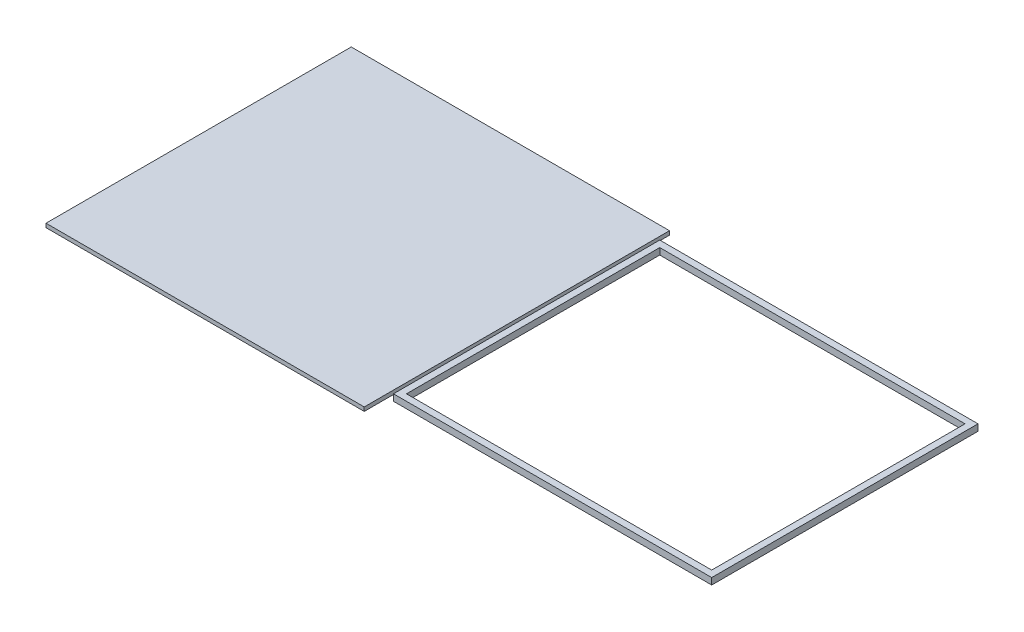
ISO-10303-21;
HEADER;
FILE_DESCRIPTION(('STEP AP214'),'2;1');
FILE_NAME('part.step','',(''),(''),'','','');
FILE_SCHEMA(('AUTOMOTIVE_DESIGN { 1 0 10303 214 1 1 1 1 }'));
ENDSEC;
DATA;
#1=APPLICATION_CONTEXT('core data for automotive mechanical design processes');
#2=APPLICATION_PROTOCOL_DEFINITION('international standard','automotive_design',2000,#1);
#3=PRODUCT_CONTEXT('',#1,'mechanical');
#4=PRODUCT('Part','Part','',(#3));
#5=PRODUCT_RELATED_PRODUCT_CATEGORY('part','',(#4));
#6=PRODUCT_DEFINITION_FORMATION('','',#4);
#7=PRODUCT_DEFINITION_CONTEXT('part definition',#1,'design');
#8=PRODUCT_DEFINITION('design','',#6,#7);
#9=PRODUCT_DEFINITION_SHAPE('','',#8);
#10=(LENGTH_UNIT() NAMED_UNIT(*) SI_UNIT(.MILLI.,.METRE.));
#11=(NAMED_UNIT(*) PLANE_ANGLE_UNIT() SI_UNIT($,.RADIAN.));
#12=(NAMED_UNIT(*) SI_UNIT($,.STERADIAN.) SOLID_ANGLE_UNIT());
#13=UNCERTAINTY_MEASURE_WITH_UNIT(LENGTH_MEASURE(1.E-05),#10,'distance_accuracy_value','');
#14=(GEOMETRIC_REPRESENTATION_CONTEXT(3) GLOBAL_UNCERTAINTY_ASSIGNED_CONTEXT((#13)) GLOBAL_UNIT_ASSIGNED_CONTEXT((#10,
#11,#12)) REPRESENTATION_CONTEXT('',''));
#15=CARTESIAN_POINT('',(0.,0.,0.));
#16=DIRECTION('',(0.,0.,1.));
#17=DIRECTION('',(1.,0.,0.));
#18=AXIS2_PLACEMENT_3D('',#15,#16,#17);
#19=CARTESIAN_POINT('',(0.,8.,0.));
#20=DIRECTION('',(0.,1.,0.));
#21=DIRECTION('',(0.,0.,1.));
#22=AXIS2_PLACEMENT_3D('',#19,#20,#21);
#23=PLANE('',#22);
#24=DIRECTION('',(0.,0.,1.));
#25=VECTOR('',#24,1.);
#26=CARTESIAN_POINT('',(130.,8.,102.5));
#27=LINE('',#26,#25);
#28=CARTESIAN_POINT('',(130.,8.,-102.5));
#29=VERTEX_POINT('',#28);
#30=CARTESIAN_POINT('',(130.,8.,102.5));
#31=VERTEX_POINT('',#30);
#32=EDGE_CURVE('E150',#29,#31,#27,.T.);
#33=ORIENTED_EDGE('',*,*,#32,.T.);
#34=DIRECTION('',(1.,0.,0.));
#35=VECTOR('',#34,1.);
#36=CARTESIAN_POINT('',(375.,8.,102.5));
#37=LINE('',#36,#35);
#38=CARTESIAN_POINT('',(375.,8.,102.5));
#39=VERTEX_POINT('',#38);
#40=EDGE_CURVE('E153',#31,#39,#37,.T.);
#41=ORIENTED_EDGE('',*,*,#40,.T.);
#42=DIRECTION('',(0.,0.,-1.));
#43=VECTOR('',#42,1.);
#44=CARTESIAN_POINT('',(375.,8.,102.5));
#45=LINE('',#44,#43);
#46=CARTESIAN_POINT('',(375.,8.,-102.5));
#47=VERTEX_POINT('',#46);
#48=EDGE_CURVE('E156',#39,#47,#45,.T.);
#49=ORIENTED_EDGE('',*,*,#48,.T.);
#50=DIRECTION('',(-1.,0.,0.));
#51=VECTOR('',#50,1.);
#52=CARTESIAN_POINT('',(375.,8.,-102.5));
#53=LINE('',#52,#51);
#54=EDGE_CURVE('E158',#47,#29,#53,.T.);
#55=ORIENTED_EDGE('',*,*,#54,.T.);
#56=EDGE_LOOP('',(#33,#41,#49,#55));
#57=FACE_BOUND('',#56,.T.);
#58=DIRECTION('',(0.,0.,-1.));
#59=VECTOR('',#58,1.);
#60=CARTESIAN_POINT('',(370.,8.,97.5));
#61=LINE('',#60,#59);
#62=CARTESIAN_POINT('',(370.,8.,97.5));
#63=VERTEX_POINT('',#62);
#64=CARTESIAN_POINT('',(370.,8.,-97.5));
#65=VERTEX_POINT('',#64);
#66=EDGE_CURVE('E122',#63,#65,#61,.T.);
#67=ORIENTED_EDGE('',*,*,#66,.F.);
#68=DIRECTION('',(1.,0.,0.));
#69=VECTOR('',#68,1.);
#70=CARTESIAN_POINT('',(370.,8.,97.5));
#71=LINE('',#70,#69);
#72=CARTESIAN_POINT('',(135.,8.,97.5));
#73=VERTEX_POINT('',#72);
#74=EDGE_CURVE('E114',#73,#63,#71,.T.);
#75=ORIENTED_EDGE('',*,*,#74,.F.);
#76=DIRECTION('',(0.,0.,1.));
#77=VECTOR('',#76,1.);
#78=CARTESIAN_POINT('',(135.,8.,97.5));
#79=LINE('',#78,#77);
#80=CARTESIAN_POINT('',(135.,8.,-97.5));
#81=VERTEX_POINT('',#80);
#82=EDGE_CURVE('E136',#81,#73,#79,.T.);
#83=ORIENTED_EDGE('',*,*,#82,.F.);
#84=DIRECTION('',(-1.,0.,0.));
#85=VECTOR('',#84,1.);
#86=CARTESIAN_POINT('',(370.,8.,-97.5));
#87=LINE('',#86,#85);
#88=EDGE_CURVE('E134',#65,#81,#87,.T.);
#89=ORIENTED_EDGE('',*,*,#88,.F.);
#90=EDGE_LOOP('',(#67,#75,#83,#89));
#91=FACE_BOUND('',#90,.T.);
#92=ADVANCED_FACE('F49',(#57,#91),#23,.T.);
#93=CARTESIAN_POINT('',(0.,3.,0.));
#94=DIRECTION('',(0.,1.,0.));
#95=DIRECTION('',(0.,0.,1.));
#96=AXIS2_PLACEMENT_3D('',#93,#94,#95);
#97=PLANE('',#96);
#98=DIRECTION('',(0.,0.,1.));
#99=VECTOR('',#98,1.);
#100=CARTESIAN_POINT('',(130.,3.,102.5));
#101=LINE('',#100,#99);
#102=CARTESIAN_POINT('',(130.,3.,-102.5));
#103=VERTEX_POINT('',#102);
#104=CARTESIAN_POINT('',(130.,3.,102.5));
#105=VERTEX_POINT('',#104);
#106=EDGE_CURVE('E130',#103,#105,#101,.T.);
#107=ORIENTED_EDGE('',*,*,#106,.F.);
#108=DIRECTION('',(-1.,0.,0.));
#109=VECTOR('',#108,1.);
#110=CARTESIAN_POINT('',(375.,3.,-102.5));
#111=LINE('',#110,#109);
#112=CARTESIAN_POINT('',(375.,3.,-102.5));
#113=VERTEX_POINT('',#112);
#114=EDGE_CURVE('E154',#113,#103,#111,.T.);
#115=ORIENTED_EDGE('',*,*,#114,.F.);
#116=DIRECTION('',(0.,0.,-1.));
#117=VECTOR('',#116,1.);
#118=CARTESIAN_POINT('',(375.,3.,102.5));
#119=LINE('',#118,#117);
#120=CARTESIAN_POINT('',(375.,3.,102.5));
#121=VERTEX_POINT('',#120);
#122=EDGE_CURVE('E165',#121,#113,#119,.T.);
#123=ORIENTED_EDGE('',*,*,#122,.F.);
#124=DIRECTION('',(1.,0.,0.));
#125=VECTOR('',#124,1.);
#126=CARTESIAN_POINT('',(375.,3.,102.5));
#127=LINE('',#126,#125);
#128=EDGE_CURVE('E163',#105,#121,#127,.T.);
#129=ORIENTED_EDGE('',*,*,#128,.F.);
#130=EDGE_LOOP('',(#107,#115,#123,#129));
#131=FACE_BOUND('',#130,.T.);
#132=DIRECTION('',(1.,0.,0.));
#133=VECTOR('',#132,1.);
#134=CARTESIAN_POINT('',(370.,3.,97.5));
#135=LINE('',#134,#133);
#136=CARTESIAN_POINT('',(135.,3.,97.5));
#137=VERTEX_POINT('',#136);
#138=CARTESIAN_POINT('',(370.,3.,97.5));
#139=VERTEX_POINT('',#138);
#140=EDGE_CURVE('E72',#137,#139,#135,.T.);
#141=ORIENTED_EDGE('',*,*,#140,.T.);
#142=DIRECTION('',(0.,0.,-1.));
#143=VECTOR('',#142,1.);
#144=CARTESIAN_POINT('',(370.,3.,97.5));
#145=LINE('',#144,#143);
#146=CARTESIAN_POINT('',(370.,3.,-97.5));
#147=VERTEX_POINT('',#146);
#148=EDGE_CURVE('E129',#139,#147,#145,.T.);
#149=ORIENTED_EDGE('',*,*,#148,.T.);
#150=DIRECTION('',(-1.,0.,0.));
#151=VECTOR('',#150,1.);
#152=CARTESIAN_POINT('',(370.,3.,-97.5));
#153=LINE('',#152,#151);
#154=CARTESIAN_POINT('',(135.,3.,-97.5));
#155=VERTEX_POINT('',#154);
#156=EDGE_CURVE('E142',#147,#155,#153,.T.);
#157=ORIENTED_EDGE('',*,*,#156,.T.);
#158=DIRECTION('',(0.,0.,1.));
#159=VECTOR('',#158,1.);
#160=CARTESIAN_POINT('',(135.,3.,97.5));
#161=LINE('',#160,#159);
#162=EDGE_CURVE('E123',#155,#137,#161,.T.);
#163=ORIENTED_EDGE('',*,*,#162,.T.);
#164=EDGE_LOOP('',(#141,#149,#157,#163));
#165=FACE_BOUND('',#164,.T.);
#166=ADVANCED_FACE('F183',(#131,#165),#97,.F.);
#167=CARTESIAN_POINT('',(130.,8.,102.5));
#168=DIRECTION('',(1.,0.,0.));
#169=DIRECTION('',(0.,0.,-1.));
#170=AXIS2_PLACEMENT_3D('',#167,#168,#169);
#171=PLANE('',#170);
#172=ORIENTED_EDGE('',*,*,#106,.T.);
#173=DIRECTION('',(0.,-1.,0.));
#174=VECTOR('',#173,1.);
#175=CARTESIAN_POINT('',(130.,8.,102.5));
#176=LINE('',#175,#174);
#177=EDGE_CURVE('E12',#31,#105,#176,.T.);
#178=ORIENTED_EDGE('',*,*,#177,.F.);
#179=ORIENTED_EDGE('',*,*,#32,.F.);
#180=DIRECTION('',(0.,-1.,0.));
#181=VECTOR('',#180,1.);
#182=CARTESIAN_POINT('',(130.,8.,-102.5));
#183=LINE('',#182,#181);
#184=EDGE_CURVE('E160',#29,#103,#183,.T.);
#185=ORIENTED_EDGE('',*,*,#184,.T.);
#186=EDGE_LOOP('',(#172,#178,#179,#185));
#187=FACE_BOUND('',#186,.T.);
#188=ADVANCED_FACE('F51',(#187),#171,.F.);
#189=CARTESIAN_POINT('',(375.,8.,102.5));
#190=DIRECTION('',(0.,0.,-1.));
#191=DIRECTION('',(-1.,0.,0.));
#192=AXIS2_PLACEMENT_3D('',#189,#190,#191);
#193=PLANE('',#192);
#194=ORIENTED_EDGE('',*,*,#128,.T.);
#195=DIRECTION('',(0.,-1.,0.));
#196=VECTOR('',#195,1.);
#197=CARTESIAN_POINT('',(375.,8.,102.5));
#198=LINE('',#197,#196);
#199=EDGE_CURVE('E57',#39,#121,#198,.T.);
#200=ORIENTED_EDGE('',*,*,#199,.F.);
#201=ORIENTED_EDGE('',*,*,#40,.F.);
#202=ORIENTED_EDGE('',*,*,#177,.T.);
#203=EDGE_LOOP('',(#194,#200,#201,#202));
#204=FACE_BOUND('',#203,.T.);
#205=ADVANCED_FACE('F193',(#204),#193,.F.);
#206=CARTESIAN_POINT('',(375.,8.,102.5));
#207=DIRECTION('',(-1.,0.,0.));
#208=DIRECTION('',(0.,0.,1.));
#209=AXIS2_PLACEMENT_3D('',#206,#207,#208);
#210=PLANE('',#209);
#211=ORIENTED_EDGE('',*,*,#122,.T.);
#212=DIRECTION('',(0.,-1.,0.));
#213=VECTOR('',#212,1.);
#214=CARTESIAN_POINT('',(375.,8.,-102.5));
#215=LINE('',#214,#213);
#216=EDGE_CURVE('E170',#47,#113,#215,.T.);
#217=ORIENTED_EDGE('',*,*,#216,.F.);
#218=ORIENTED_EDGE('',*,*,#48,.F.);
#219=ORIENTED_EDGE('',*,*,#199,.T.);
#220=EDGE_LOOP('',(#211,#217,#218,#219));
#221=FACE_BOUND('',#220,.T.);
#222=ADVANCED_FACE('F177',(#221),#210,.F.);
#223=CARTESIAN_POINT('',(375.,8.,-102.5));
#224=DIRECTION('',(0.,0.,1.));
#225=DIRECTION('',(1.,0.,0.));
#226=AXIS2_PLACEMENT_3D('',#223,#224,#225);
#227=PLANE('',#226);
#228=ORIENTED_EDGE('',*,*,#114,.T.);
#229=ORIENTED_EDGE('',*,*,#184,.F.);
#230=ORIENTED_EDGE('',*,*,#54,.F.);
#231=ORIENTED_EDGE('',*,*,#216,.T.);
#232=EDGE_LOOP('',(#228,#229,#230,#231));
#233=FACE_BOUND('',#232,.T.);
#234=ADVANCED_FACE('F187',(#233),#227,.F.);
#235=CARTESIAN_POINT('',(370.,8.,97.5));
#236=DIRECTION('',(0.,0.,-1.));
#237=DIRECTION('',(-1.,0.,0.));
#238=AXIS2_PLACEMENT_3D('',#235,#236,#237);
#239=PLANE('',#238);
#240=ORIENTED_EDGE('',*,*,#140,.F.);
#241=DIRECTION('',(0.,-1.,0.));
#242=VECTOR('',#241,1.);
#243=CARTESIAN_POINT('',(135.,8.,97.5));
#244=LINE('',#243,#242);
#245=EDGE_CURVE('E118',#73,#137,#244,.T.);
#246=ORIENTED_EDGE('',*,*,#245,.F.);
#247=ORIENTED_EDGE('',*,*,#74,.T.);
#248=DIRECTION('',(0.,-1.,0.));
#249=VECTOR('',#248,1.);
#250=CARTESIAN_POINT('',(370.,8.,97.5));
#251=LINE('',#250,#249);
#252=EDGE_CURVE('E117',#63,#139,#251,.T.);
#253=ORIENTED_EDGE('',*,*,#252,.T.);
#254=EDGE_LOOP('',(#240,#246,#247,#253));
#255=FACE_BOUND('',#254,.T.);
#256=ADVANCED_FACE('F116',(#255),#239,.T.);
#257=CARTESIAN_POINT('',(370.,8.,97.5));
#258=DIRECTION('',(-1.,0.,0.));
#259=DIRECTION('',(0.,0.,1.));
#260=AXIS2_PLACEMENT_3D('',#257,#258,#259);
#261=PLANE('',#260);
#262=ORIENTED_EDGE('',*,*,#148,.F.);
#263=ORIENTED_EDGE('',*,*,#252,.F.);
#264=ORIENTED_EDGE('',*,*,#66,.T.);
#265=DIRECTION('',(0.,-1.,0.));
#266=VECTOR('',#265,1.);
#267=CARTESIAN_POINT('',(370.,8.,-97.5));
#268=LINE('',#267,#266);
#269=EDGE_CURVE('E131',#65,#147,#268,.T.);
#270=ORIENTED_EDGE('',*,*,#269,.T.);
#271=EDGE_LOOP('',(#262,#263,#264,#270));
#272=FACE_BOUND('',#271,.T.);
#273=ADVANCED_FACE('F126',(#272),#261,.T.);
#274=CARTESIAN_POINT('',(370.,8.,-97.5));
#275=DIRECTION('',(0.,0.,1.));
#276=DIRECTION('',(1.,0.,0.));
#277=AXIS2_PLACEMENT_3D('',#274,#275,#276);
#278=PLANE('',#277);
#279=ORIENTED_EDGE('',*,*,#156,.F.);
#280=ORIENTED_EDGE('',*,*,#269,.F.);
#281=ORIENTED_EDGE('',*,*,#88,.T.);
#282=DIRECTION('',(0.,-1.,0.));
#283=VECTOR('',#282,1.);
#284=CARTESIAN_POINT('',(135.,8.,-97.5));
#285=LINE('',#284,#283);
#286=EDGE_CURVE('E64',#81,#155,#285,.T.);
#287=ORIENTED_EDGE('',*,*,#286,.T.);
#288=EDGE_LOOP('',(#279,#280,#281,#287));
#289=FACE_BOUND('',#288,.T.);
#290=ADVANCED_FACE('F216',(#289),#278,.T.);
#291=CARTESIAN_POINT('',(135.,8.,97.5));
#292=DIRECTION('',(1.,0.,0.));
#293=DIRECTION('',(0.,0.,-1.));
#294=AXIS2_PLACEMENT_3D('',#291,#292,#293);
#295=PLANE('',#294);
#296=ORIENTED_EDGE('',*,*,#162,.F.);
#297=ORIENTED_EDGE('',*,*,#286,.F.);
#298=ORIENTED_EDGE('',*,*,#82,.T.);
#299=ORIENTED_EDGE('',*,*,#245,.T.);
#300=EDGE_LOOP('',(#296,#297,#298,#299));
#301=FACE_BOUND('',#300,.T.);
#302=ADVANCED_FACE('F220',(#301),#295,.T.);
#303=CLOSED_SHELL('',(#92,#166,#188,#205,#222,#234,#256,#273,#290,#302));
#304=MANIFOLD_SOLID_BREP('B2',#303);
#305=CARTESIAN_POINT('',(-122.5,3.,117.5));
#306=DIRECTION('',(1.,0.,0.));
#307=DIRECTION('',(0.,0.,-1.));
#308=AXIS2_PLACEMENT_3D('',#305,#306,#307);
#309=PLANE('',#308);
#310=DIRECTION('',(0.,0.,1.));
#311=VECTOR('',#310,1.);
#312=CARTESIAN_POINT('',(-122.5,0.,117.5));
#313=LINE('',#312,#311);
#314=CARTESIAN_POINT('',(-122.5,0.,-117.5));
#315=VERTEX_POINT('',#314);
#316=CARTESIAN_POINT('',(-122.5,0.,117.5));
#317=VERTEX_POINT('',#316);
#318=EDGE_CURVE('E362',#315,#317,#313,.T.);
#319=ORIENTED_EDGE('',*,*,#318,.T.);
#320=DIRECTION('',(0.,-1.,0.));
#321=VECTOR('',#320,1.);
#322=CARTESIAN_POINT('',(-122.5,3.,117.5));
#323=LINE('',#322,#321);
#324=CARTESIAN_POINT('',(-122.5,3.,117.5));
#325=VERTEX_POINT('',#324);
#326=EDGE_CURVE('E47',#325,#317,#323,.T.);
#327=ORIENTED_EDGE('',*,*,#326,.F.);
#328=DIRECTION('',(0.,0.,1.));
#329=VECTOR('',#328,1.);
#330=CARTESIAN_POINT('',(-122.5,3.,117.5));
#331=LINE('',#330,#329);
#332=CARTESIAN_POINT('',(-122.5,3.,-117.5));
#333=VERTEX_POINT('',#332);
#334=EDGE_CURVE('E350',#333,#325,#331,.T.);
#335=ORIENTED_EDGE('',*,*,#334,.F.);
#336=DIRECTION('',(0.,-1.,0.));
#337=VECTOR('',#336,1.);
#338=CARTESIAN_POINT('',(-122.5,3.,-117.5));
#339=LINE('',#338,#337);
#340=EDGE_CURVE('E358',#333,#315,#339,.T.);
#341=ORIENTED_EDGE('',*,*,#340,.T.);
#342=EDGE_LOOP('',(#319,#327,#335,#341));
#343=FACE_BOUND('',#342,.T.);
#344=ADVANCED_FACE('F299',(#343),#309,.F.);
#345=CARTESIAN_POINT('',(122.5,3.,117.5));
#346=DIRECTION('',(0.,0.,-1.));
#347=DIRECTION('',(-1.,0.,0.));
#348=AXIS2_PLACEMENT_3D('',#345,#346,#347);
#349=PLANE('',#348);
#350=DIRECTION('',(1.,0.,0.));
#351=VECTOR('',#350,1.);
#352=CARTESIAN_POINT('',(122.5,0.,117.5));
#353=LINE('',#352,#351);
#354=CARTESIAN_POINT('',(122.5,0.,117.5));
#355=VERTEX_POINT('',#354);
#356=EDGE_CURVE('E354',#317,#355,#353,.T.);
#357=ORIENTED_EDGE('',*,*,#356,.T.);
#358=DIRECTION('',(0.,-1.,0.));
#359=VECTOR('',#358,1.);
#360=CARTESIAN_POINT('',(122.5,3.,117.5));
#361=LINE('',#360,#359);
#362=CARTESIAN_POINT('',(122.5,3.,117.5));
#363=VERTEX_POINT('',#362);
#364=EDGE_CURVE('E307',#363,#355,#361,.T.);
#365=ORIENTED_EDGE('',*,*,#364,.F.);
#366=DIRECTION('',(1.,0.,0.));
#367=VECTOR('',#366,1.);
#368=CARTESIAN_POINT('',(122.5,3.,117.5));
#369=LINE('',#368,#367);
#370=EDGE_CURVE('E345',#325,#363,#369,.T.);
#371=ORIENTED_EDGE('',*,*,#370,.F.);
#372=ORIENTED_EDGE('',*,*,#326,.T.);
#373=EDGE_LOOP('',(#357,#365,#371,#372));
#374=FACE_BOUND('',#373,.T.);
#375=ADVANCED_FACE('F353',(#374),#349,.F.);
#376=CARTESIAN_POINT('',(122.5,3.,117.5));
#377=DIRECTION('',(-1.,0.,0.));
#378=DIRECTION('',(0.,0.,1.));
#379=AXIS2_PLACEMENT_3D('',#376,#377,#378);
#380=PLANE('',#379);
#381=DIRECTION('',(0.,0.,-1.));
#382=VECTOR('',#381,1.);
#383=CARTESIAN_POINT('',(122.5,0.,117.5));
#384=LINE('',#383,#382);
#385=CARTESIAN_POINT('',(122.5,0.,-117.5));
#386=VERTEX_POINT('',#385);
#387=EDGE_CURVE('E332',#355,#386,#384,.T.);
#388=ORIENTED_EDGE('',*,*,#387,.T.);
#389=DIRECTION('',(0.,-1.,0.));
#390=VECTOR('',#389,1.);
#391=CARTESIAN_POINT('',(122.5,3.,-117.5));
#392=LINE('',#391,#390);
#393=CARTESIAN_POINT('',(122.5,3.,-117.5));
#394=VERTEX_POINT('',#393);
#395=EDGE_CURVE('E355',#394,#386,#392,.T.);
#396=ORIENTED_EDGE('',*,*,#395,.F.);
#397=DIRECTION('',(0.,0.,-1.));
#398=VECTOR('',#397,1.);
#399=CARTESIAN_POINT('',(122.5,3.,117.5));
#400=LINE('',#399,#398);
#401=EDGE_CURVE('E348',#363,#394,#400,.T.);
#402=ORIENTED_EDGE('',*,*,#401,.F.);
#403=ORIENTED_EDGE('',*,*,#364,.T.);
#404=EDGE_LOOP('',(#388,#396,#402,#403));
#405=FACE_BOUND('',#404,.T.);
#406=ADVANCED_FACE('F356',(#405),#380,.F.);
#407=CARTESIAN_POINT('',(122.5,3.,-117.5));
#408=DIRECTION('',(0.,0.,1.));
#409=DIRECTION('',(1.,0.,0.));
#410=AXIS2_PLACEMENT_3D('',#407,#408,#409);
#411=PLANE('',#410);
#412=DIRECTION('',(-1.,0.,0.));
#413=VECTOR('',#412,1.);
#414=CARTESIAN_POINT('',(122.5,0.,-117.5));
#415=LINE('',#414,#413);
#416=EDGE_CURVE('E338',#386,#315,#415,.T.);
#417=ORIENTED_EDGE('',*,*,#416,.T.);
#418=ORIENTED_EDGE('',*,*,#340,.F.);
#419=DIRECTION('',(-1.,0.,0.));
#420=VECTOR('',#419,1.);
#421=CARTESIAN_POINT('',(122.5,3.,-117.5));
#422=LINE('',#421,#420);
#423=EDGE_CURVE('E315',#394,#333,#422,.T.);
#424=ORIENTED_EDGE('',*,*,#423,.F.);
#425=ORIENTED_EDGE('',*,*,#395,.T.);
#426=EDGE_LOOP('',(#417,#418,#424,#425));
#427=FACE_BOUND('',#426,.T.);
#428=ADVANCED_FACE('F369',(#427),#411,.F.);
#429=CARTESIAN_POINT('',(0.,3.,0.));
#430=DIRECTION('',(0.,1.,0.));
#431=DIRECTION('',(0.,0.,1.));
#432=AXIS2_PLACEMENT_3D('',#429,#430,#431);
#433=PLANE('',#432);
#434=ORIENTED_EDGE('',*,*,#334,.T.);
#435=ORIENTED_EDGE('',*,*,#370,.T.);
#436=ORIENTED_EDGE('',*,*,#401,.T.);
#437=ORIENTED_EDGE('',*,*,#423,.T.);
#438=EDGE_LOOP('',(#434,#435,#436,#437));
#439=FACE_BOUND('',#438,.T.);
#440=ADVANCED_FACE('F346',(#439),#433,.T.);
#441=CARTESIAN_POINT('',(0.,0.,0.));
#442=DIRECTION('',(0.,1.,0.));
#443=DIRECTION('',(0.,0.,1.));
#444=AXIS2_PLACEMENT_3D('',#441,#442,#443);
#445=PLANE('',#444);
#446=ORIENTED_EDGE('',*,*,#318,.F.);
#447=ORIENTED_EDGE('',*,*,#416,.F.);
#448=ORIENTED_EDGE('',*,*,#387,.F.);
#449=ORIENTED_EDGE('',*,*,#356,.F.);
#450=EDGE_LOOP('',(#446,#447,#448,#449));
#451=FACE_BOUND('',#450,.T.);
#452=ADVANCED_FACE('F372',(#451),#445,.F.);
#453=CLOSED_SHELL('',(#344,#375,#406,#428,#440,#452));
#454=MANIFOLD_SOLID_BREP('B6',#453);
#455=ADVANCED_BREP_SHAPE_REPRESENTATION('',(#18,#304,#454),#14);
#456=SHAPE_DEFINITION_REPRESENTATION(#9,#455);
ENDSEC;
END-ISO-10303-21;
